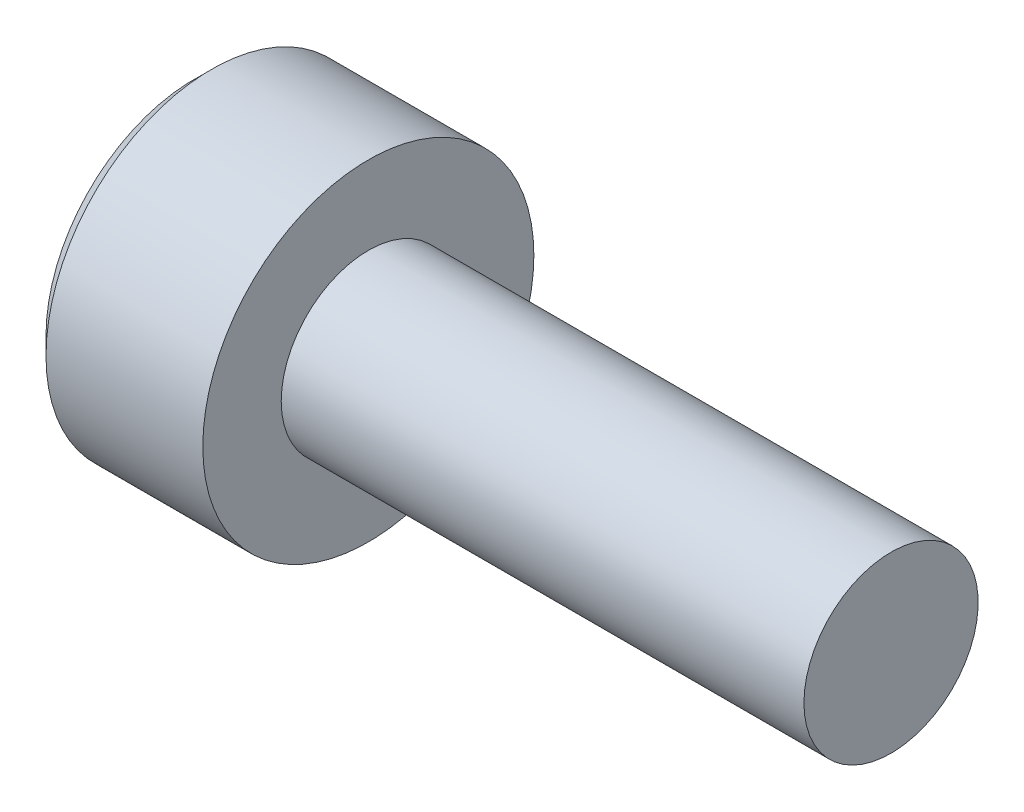
ISO-10303-21;
HEADER;
FILE_DESCRIPTION(('STEP AP214'),'2;1');
FILE_NAME('part.step','',(''),(''),'','','');
FILE_SCHEMA(('AUTOMOTIVE_DESIGN { 1 0 10303 214 1 1 1 1 }'));
ENDSEC;
DATA;
#1=APPLICATION_CONTEXT('core data for automotive mechanical design processes');
#2=APPLICATION_PROTOCOL_DEFINITION('international standard','automotive_design',2000,#1);
#3=PRODUCT_CONTEXT('',#1,'mechanical');
#4=PRODUCT('Part','Part','',(#3));
#5=PRODUCT_RELATED_PRODUCT_CATEGORY('part','',(#4));
#6=PRODUCT_DEFINITION_FORMATION('','',#4);
#7=PRODUCT_DEFINITION_CONTEXT('part definition',#1,'design');
#8=PRODUCT_DEFINITION('design','',#6,#7);
#9=PRODUCT_DEFINITION_SHAPE('','',#8);
#10=(LENGTH_UNIT() NAMED_UNIT(*) SI_UNIT(.MILLI.,.METRE.));
#11=(NAMED_UNIT(*) PLANE_ANGLE_UNIT() SI_UNIT($,.RADIAN.));
#12=(NAMED_UNIT(*) SI_UNIT($,.STERADIAN.) SOLID_ANGLE_UNIT());
#13=UNCERTAINTY_MEASURE_WITH_UNIT(LENGTH_MEASURE(1.E-05),#10,'distance_accuracy_value','');
#14=(GEOMETRIC_REPRESENTATION_CONTEXT(3) GLOBAL_UNCERTAINTY_ASSIGNED_CONTEXT((#13)) GLOBAL_UNIT_ASSIGNED_CONTEXT((#10,
#11,#12)) REPRESENTATION_CONTEXT('',''));
#15=CARTESIAN_POINT('',(0.,0.,0.));
#16=DIRECTION('',(0.,0.,1.));
#17=DIRECTION('',(1.,0.,0.));
#18=AXIS2_PLACEMENT_3D('',#15,#16,#17);
#19=CARTESIAN_POINT('',(-0.999999999976353,0.,0.));
#20=DIRECTION('',(-1.,0.,0.));
#21=DIRECTION('',(0.,0.,1.));
#22=AXIS2_PLACEMENT_3D('',#19,#20,#21);
#23=CONICAL_SURFACE('',#22,0.749999999868578,1.30899693854199);
#24=CARTESIAN_POINT('',(-0.79903810542703,0.,-5.40012479177676E-10));
#25=VERTEX_POINT('',#24);
#26=VERTEX_LOOP('',#25);
#27=FACE_BOUND('',#26,.T.);
#28=CARTESIAN_POINT('',(-1.00000000000682,0.,0.));
#29=DIRECTION('',(-1.,0.,0.));
#30=DIRECTION('',(0.,0.,1.));
#31=AXIS2_PLACEMENT_3D('',#28,#29,#30);
#32=CIRCLE('',#31,0.749999999982265);
#33=CARTESIAN_POINT('',(-1.00000000000892,0.64951905283065,-0.374999999995567));
#34=VERTEX_POINT('',#33);
#35=CARTESIAN_POINT('',(-1.00000000000952,0.,-0.749999999991132));
#36=VERTEX_POINT('',#35);
#37=EDGE_CURVE('E139',#34,#36,#32,.T.);
#38=ORIENTED_EDGE('',*,*,#37,.T.);
#39=CARTESIAN_POINT('',(-1.00000000000682,0.,0.));
#40=DIRECTION('',(-1.,0.,0.));
#41=DIRECTION('',(0.,0.,1.));
#42=AXIS2_PLACEMENT_3D('',#39,#40,#41);
#43=CIRCLE('',#42,0.749999999982265);
#44=CARTESIAN_POINT('',(-1.00000000000892,-0.649519052830649,-0.374999999995567));
#45=VERTEX_POINT('',#44);
#46=EDGE_CURVE('E137',#36,#45,#43,.T.);
#47=ORIENTED_EDGE('',*,*,#46,.T.);
#48=CARTESIAN_POINT('',(-1.00000000000682,0.,0.));
#49=DIRECTION('',(-1.,0.,0.));
#50=DIRECTION('',(0.,0.,1.));
#51=AXIS2_PLACEMENT_3D('',#48,#49,#50);
#52=CIRCLE('',#51,0.749999999982265);
#53=CARTESIAN_POINT('',(-1.00000000000892,-0.64951905283065,0.374999999995567));
#54=VERTEX_POINT('',#53);
#55=EDGE_CURVE('E89',#45,#54,#52,.T.);
#56=ORIENTED_EDGE('',*,*,#55,.T.);
#57=CARTESIAN_POINT('',(-1.00000000000682,0.,0.));
#58=DIRECTION('',(-1.,0.,0.));
#59=DIRECTION('',(0.,0.,1.));
#60=AXIS2_PLACEMENT_3D('',#57,#58,#59);
#61=CIRCLE('',#60,0.749999999982265);
#62=CARTESIAN_POINT('',(-1.00000000000952,0.,0.749999999991132));
#63=VERTEX_POINT('',#62);
#64=EDGE_CURVE('E20',#54,#63,#61,.T.);
#65=ORIENTED_EDGE('',*,*,#64,.T.);
#66=CARTESIAN_POINT('',(-1.00000000000682,0.,0.));
#67=DIRECTION('',(-1.,0.,0.));
#68=DIRECTION('',(0.,0.,1.));
#69=AXIS2_PLACEMENT_3D('',#66,#67,#68);
#70=CIRCLE('',#69,0.749999999982265);
#71=CARTESIAN_POINT('',(-1.00000000000892,0.64951905283065,0.374999999995567));
#72=VERTEX_POINT('',#71);
#73=EDGE_CURVE('E94',#63,#72,#70,.T.);
#74=ORIENTED_EDGE('',*,*,#73,.T.);
#75=CARTESIAN_POINT('',(-1.00000000000682,0.,0.));
#76=DIRECTION('',(-1.,0.,0.));
#77=DIRECTION('',(0.,0.,1.));
#78=AXIS2_PLACEMENT_3D('',#75,#76,#77);
#79=CIRCLE('',#78,0.749999999982265);
#80=EDGE_CURVE('E115',#72,#34,#79,.T.);
#81=ORIENTED_EDGE('',*,*,#80,.T.);
#82=EDGE_LOOP('',(#38,#47,#56,#65,#74,#81));
#83=FACE_BOUND('',#82,.T.);
#84=ADVANCED_FACE('F17',(#27,#83),#23,.F.);
#85=CARTESIAN_POINT('',(-1.,0.,0.));
#86=DIRECTION('',(1.,0.,0.));
#87=DIRECTION('',(0.,0.,-1.));
#88=AXIS2_PLACEMENT_3D('',#85,#86,#87);
#89=PLANE('',#88);
#90=DIRECTION('',(0.,1.,0.));
#91=VECTOR('',#90,1.);
#92=CARTESIAN_POINT('',(-1.00000000001222,0.43301270189222,0.75));
#93=LINE('',#92,#91);
#94=CARTESIAN_POINT('',(-1.00000000000611,-0.433012701895382,0.749999999994524));
#95=VERTEX_POINT('',#94);
#96=EDGE_CURVE('E99',#63,#95,#93,.F.);
#97=ORIENTED_EDGE('',*,*,#96,.F.);
#98=ORIENTED_EDGE('',*,*,#64,.F.);
#99=DIRECTION('',(0.,0.500000000000001,0.866025403784438));
#100=VECTOR('',#99,1.);
#101=CARTESIAN_POINT('',(-1.,-0.43301270189222,0.75));
#102=LINE('',#101,#100);
#103=EDGE_CURVE('E101',#95,#54,#102,.F.);
#104=ORIENTED_EDGE('',*,*,#103,.F.);
#105=EDGE_LOOP('',(#97,#98,#104));
#106=FACE_BOUND('',#105,.T.);
#107=ADVANCED_FACE('F100',(#106),#89,.F.);
#108=CARTESIAN_POINT('',(-1.,0.,0.));
#109=DIRECTION('',(1.,0.,0.));
#110=DIRECTION('',(0.,0.,-1.));
#111=AXIS2_PLACEMENT_3D('',#108,#109,#110);
#112=PLANE('',#111);
#113=DIRECTION('',(0.,0.500000000000001,-0.866025403784438));
#114=VECTOR('',#113,1.);
#115=CARTESIAN_POINT('',(-1.00000000001102,0.86602540378444,0.));
#116=LINE('',#115,#114);
#117=CARTESIAN_POINT('',(-1.00000000000551,0.43301270189222,0.75));
#118=VERTEX_POINT('',#117);
#119=EDGE_CURVE('E113',#72,#118,#116,.F.);
#120=ORIENTED_EDGE('',*,*,#119,.F.);
#121=ORIENTED_EDGE('',*,*,#73,.F.);
#122=DIRECTION('',(0.,1.,0.));
#123=VECTOR('',#122,1.);
#124=CARTESIAN_POINT('',(-1.,0.43301270189222,0.75));
#125=LINE('',#124,#123);
#126=EDGE_CURVE('E110',#118,#63,#125,.F.);
#127=ORIENTED_EDGE('',*,*,#126,.F.);
#128=EDGE_LOOP('',(#120,#121,#127));
#129=FACE_BOUND('',#128,.T.);
#130=ADVANCED_FACE('F109',(#129),#112,.F.);
#131=CARTESIAN_POINT('',(-1.,0.,0.));
#132=DIRECTION('',(1.,0.,0.));
#133=DIRECTION('',(0.,0.,-1.));
#134=AXIS2_PLACEMENT_3D('',#131,#132,#133);
#135=PLANE('',#134);
#136=DIRECTION('',(0.,0.500000000000001,-0.866025403784438));
#137=VECTOR('',#136,1.);
#138=CARTESIAN_POINT('',(-1.,0.86602540378444,0.));
#139=LINE('',#138,#137);
#140=CARTESIAN_POINT('',(-1.00000000000551,0.86602540378444,0.));
#141=VERTEX_POINT('',#140);
#142=EDGE_CURVE('E149',#141,#72,#139,.F.);
#143=ORIENTED_EDGE('',*,*,#142,.F.);
#144=DIRECTION('',(0.,-0.500000000000001,-0.866025403784438));
#145=VECTOR('',#144,1.);
#146=CARTESIAN_POINT('',(-1.00000000001102,0.43301270189222,-0.75));
#147=LINE('',#146,#145);
#148=EDGE_CURVE('E147',#34,#141,#147,.F.);
#149=ORIENTED_EDGE('',*,*,#148,.F.);
#150=ORIENTED_EDGE('',*,*,#80,.F.);
#151=EDGE_LOOP('',(#143,#149,#150));
#152=FACE_BOUND('',#151,.T.);
#153=ADVANCED_FACE('F148',(#152),#135,.F.);
#154=CARTESIAN_POINT('',(-1.,0.,0.));
#155=DIRECTION('',(1.,0.,0.));
#156=DIRECTION('',(0.,0.,-1.));
#157=AXIS2_PLACEMENT_3D('',#154,#155,#156);
#158=PLANE('',#157);
#159=DIRECTION('',(0.,1.,0.));
#160=VECTOR('',#159,1.);
#161=CARTESIAN_POINT('',(-1.00000000001222,-0.43301270189222,-0.75));
#162=LINE('',#161,#160);
#163=CARTESIAN_POINT('',(-1.00000000000611,0.433012701895382,-0.749999999994524));
#164=VERTEX_POINT('',#163);
#165=EDGE_CURVE('E161',#36,#164,#162,.T.);
#166=ORIENTED_EDGE('',*,*,#165,.F.);
#167=ORIENTED_EDGE('',*,*,#37,.F.);
#168=DIRECTION('',(0.,-0.500000000000001,-0.866025403784438));
#169=VECTOR('',#168,1.);
#170=CARTESIAN_POINT('',(-1.,0.43301270189222,-0.75));
#171=LINE('',#170,#169);
#172=EDGE_CURVE('E158',#164,#34,#171,.F.);
#173=ORIENTED_EDGE('',*,*,#172,.F.);
#174=EDGE_LOOP('',(#166,#167,#173));
#175=FACE_BOUND('',#174,.T.);
#176=ADVANCED_FACE('F157',(#175),#158,.F.);
#177=CARTESIAN_POINT('',(-1.,0.,0.));
#178=DIRECTION('',(1.,0.,0.));
#179=DIRECTION('',(0.,0.,-1.));
#180=AXIS2_PLACEMENT_3D('',#177,#178,#179);
#181=PLANE('',#180);
#182=DIRECTION('',(0.,-0.500000000000001,0.866025403784438));
#183=VECTOR('',#182,1.);
#184=CARTESIAN_POINT('',(-1.00000000001102,-0.86602540378444,0.));
#185=LINE('',#184,#183);
#186=CARTESIAN_POINT('',(-1.00000000000551,-0.43301270189222,-0.75));
#187=VERTEX_POINT('',#186);
#188=EDGE_CURVE('E187',#45,#187,#185,.F.);
#189=ORIENTED_EDGE('',*,*,#188,.F.);
#190=ORIENTED_EDGE('',*,*,#46,.F.);
#191=DIRECTION('',(0.,1.,0.));
#192=VECTOR('',#191,1.);
#193=CARTESIAN_POINT('',(-1.,-0.43301270189222,-0.75));
#194=LINE('',#193,#192);
#195=EDGE_CURVE('E191',#187,#36,#194,.T.);
#196=ORIENTED_EDGE('',*,*,#195,.F.);
#197=EDGE_LOOP('',(#189,#190,#196));
#198=FACE_BOUND('',#197,.T.);
#199=ADVANCED_FACE('F337',(#198),#181,.F.);
#200=CARTESIAN_POINT('',(-1.,0.,0.));
#201=DIRECTION('',(1.,0.,0.));
#202=DIRECTION('',(0.,0.,-1.));
#203=AXIS2_PLACEMENT_3D('',#200,#201,#202);
#204=PLANE('',#203);
#205=DIRECTION('',(0.,0.500000000000001,0.866025403784438));
#206=VECTOR('',#205,1.);
#207=CARTESIAN_POINT('',(-1.00000000001102,-0.43301270189222,0.75));
#208=LINE('',#207,#206);
#209=CARTESIAN_POINT('',(-1.00000000000367,-0.86602540378444,0.));
#210=VERTEX_POINT('',#209);
#211=EDGE_CURVE('E124',#54,#210,#208,.F.);
#212=ORIENTED_EDGE('',*,*,#211,.F.);
#213=ORIENTED_EDGE('',*,*,#55,.F.);
#214=DIRECTION('',(0.,-0.500000000000001,0.866025403784438));
#215=VECTOR('',#214,1.);
#216=CARTESIAN_POINT('',(-1.,-0.86602540378444,0.));
#217=LINE('',#216,#215);
#218=EDGE_CURVE('E192',#210,#45,#217,.F.);
#219=ORIENTED_EDGE('',*,*,#218,.F.);
#220=EDGE_LOOP('',(#212,#213,#219));
#221=FACE_BOUND('',#220,.T.);
#222=ADVANCED_FACE('F328',(#221),#204,.F.);
#223=CARTESIAN_POINT('',(-1.,-0.43301270189222,0.75));
#224=DIRECTION('',(0.,0.866025403784438,-0.500000000000001));
#225=DIRECTION('',(0.,0.500000000000001,0.866025403784438));
#226=AXIS2_PLACEMENT_3D('',#223,#224,#225);
#227=PLANE('',#226);
#228=DIRECTION('',(-1.,0.,0.));
#229=VECTOR('',#228,1.);
#230=CARTESIAN_POINT('',(-1.,-0.43301270189222,0.75));
#231=LINE('',#230,#229);
#232=CARTESIAN_POINT('',(-2.,-0.43301270189222,0.75));
#233=VERTEX_POINT('',#232);
#234=EDGE_CURVE('E106',#95,#233,#231,.T.);
#235=ORIENTED_EDGE('',*,*,#234,.F.);
#236=ORIENTED_EDGE('',*,*,#103,.T.);
#237=ORIENTED_EDGE('',*,*,#211,.T.);
#238=DIRECTION('',(1.,0.,0.));
#239=VECTOR('',#238,1.);
#240=CARTESIAN_POINT('',(-1.,-0.86602540378444,0.));
#241=LINE('',#240,#239);
#242=CARTESIAN_POINT('',(-2.,-0.86602540378444,0.));
#243=VERTEX_POINT('',#242);
#244=EDGE_CURVE('E195',#243,#210,#241,.T.);
#245=ORIENTED_EDGE('',*,*,#244,.F.);
#246=DIRECTION('',(0.,0.500000000000001,0.866025403784438));
#247=VECTOR('',#246,1.);
#248=CARTESIAN_POINT('',(-2.,-0.86602540378444,0.));
#249=LINE('',#248,#247);
#250=EDGE_CURVE('E183',#243,#233,#249,.T.);
#251=ORIENTED_EDGE('',*,*,#250,.T.);
#252=EDGE_LOOP('',(#235,#236,#237,#245,#251));
#253=FACE_BOUND('',#252,.T.);
#254=ADVANCED_FACE('F320',(#253),#227,.T.);
#255=CARTESIAN_POINT('',(-1.,0.43301270189222,0.75));
#256=DIRECTION('',(0.,0.,-1.));
#257=DIRECTION('',(-1.,0.,0.));
#258=AXIS2_PLACEMENT_3D('',#255,#256,#257);
#259=PLANE('',#258);
#260=DIRECTION('',(1.,0.,0.));
#261=VECTOR('',#260,1.);
#262=CARTESIAN_POINT('',(-1.,0.43301270189222,0.75));
#263=LINE('',#262,#261);
#264=CARTESIAN_POINT('',(-2.,0.43301270189222,0.75));
#265=VERTEX_POINT('',#264);
#266=EDGE_CURVE('E118',#118,#265,#263,.F.);
#267=ORIENTED_EDGE('',*,*,#266,.F.);
#268=ORIENTED_EDGE('',*,*,#126,.T.);
#269=ORIENTED_EDGE('',*,*,#96,.T.);
#270=ORIENTED_EDGE('',*,*,#234,.T.);
#271=DIRECTION('',(0.,1.,0.));
#272=VECTOR('',#271,1.);
#273=CARTESIAN_POINT('',(-2.,0.,0.75));
#274=LINE('',#273,#272);
#275=EDGE_CURVE('E179',#233,#265,#274,.T.);
#276=ORIENTED_EDGE('',*,*,#275,.T.);
#277=EDGE_LOOP('',(#267,#268,#269,#270,#276));
#278=FACE_BOUND('',#277,.T.);
#279=ADVANCED_FACE('F116',(#278),#259,.T.);
#280=CARTESIAN_POINT('',(-1.,0.86602540378444,0.));
#281=DIRECTION('',(0.,-0.866025403784438,-0.500000000000001));
#282=DIRECTION('',(0.,0.500000000000001,-0.866025403784438));
#283=AXIS2_PLACEMENT_3D('',#280,#281,#282);
#284=PLANE('',#283);
#285=DIRECTION('',(1.,0.,0.));
#286=VECTOR('',#285,1.);
#287=CARTESIAN_POINT('',(-1.,0.86602540378444,0.));
#288=LINE('',#287,#286);
#289=CARTESIAN_POINT('',(-2.,0.86602540378444,0.));
#290=VERTEX_POINT('',#289);
#291=EDGE_CURVE('E154',#141,#290,#288,.F.);
#292=ORIENTED_EDGE('',*,*,#291,.F.);
#293=ORIENTED_EDGE('',*,*,#142,.T.);
#294=ORIENTED_EDGE('',*,*,#119,.T.);
#295=ORIENTED_EDGE('',*,*,#266,.T.);
#296=DIRECTION('',(0.,0.500000000000001,-0.866025403784438));
#297=VECTOR('',#296,1.);
#298=CARTESIAN_POINT('',(-2.,0.43301270189222,0.75));
#299=LINE('',#298,#297);
#300=EDGE_CURVE('E173',#265,#290,#299,.T.);
#301=ORIENTED_EDGE('',*,*,#300,.T.);
#302=EDGE_LOOP('',(#292,#293,#294,#295,#301));
#303=FACE_BOUND('',#302,.T.);
#304=ADVANCED_FACE('F172',(#303),#284,.T.);
#305=CARTESIAN_POINT('',(-1.,0.43301270189222,-0.75));
#306=DIRECTION('',(0.,-0.866025403784438,0.500000000000001));
#307=DIRECTION('',(0.,-0.500000000000001,-0.866025403784438));
#308=AXIS2_PLACEMENT_3D('',#305,#306,#307);
#309=PLANE('',#308);
#310=DIRECTION('',(1.,0.,0.));
#311=VECTOR('',#310,1.);
#312=CARTESIAN_POINT('',(-1.,0.43301270189222,-0.75));
#313=LINE('',#312,#311);
#314=CARTESIAN_POINT('',(-2.,0.43301270189222,-0.75));
#315=VERTEX_POINT('',#314);
#316=EDGE_CURVE('E164',#164,#315,#313,.F.);
#317=ORIENTED_EDGE('',*,*,#316,.F.);
#318=ORIENTED_EDGE('',*,*,#172,.T.);
#319=ORIENTED_EDGE('',*,*,#148,.T.);
#320=ORIENTED_EDGE('',*,*,#291,.T.);
#321=DIRECTION('',(0.,-0.500000000000001,-0.866025403784438));
#322=VECTOR('',#321,1.);
#323=CARTESIAN_POINT('',(-2.,0.86602540378444,0.));
#324=LINE('',#323,#322);
#325=EDGE_CURVE('E180',#290,#315,#324,.T.);
#326=ORIENTED_EDGE('',*,*,#325,.T.);
#327=EDGE_LOOP('',(#317,#318,#319,#320,#326));
#328=FACE_BOUND('',#327,.T.);
#329=ADVANCED_FACE('F163',(#328),#309,.T.);
#330=CARTESIAN_POINT('',(-1.,-0.43301270189222,-0.75));
#331=DIRECTION('',(0.,0.,1.));
#332=DIRECTION('',(1.,0.,0.));
#333=AXIS2_PLACEMENT_3D('',#330,#331,#332);
#334=PLANE('',#333);
#335=DIRECTION('',(1.,0.,0.));
#336=VECTOR('',#335,1.);
#337=CARTESIAN_POINT('',(-1.,-0.43301270189222,-0.75));
#338=LINE('',#337,#336);
#339=CARTESIAN_POINT('',(-2.,-0.43301270189222,-0.75));
#340=VERTEX_POINT('',#339);
#341=EDGE_CURVE('E190',#187,#340,#338,.F.);
#342=ORIENTED_EDGE('',*,*,#341,.F.);
#343=ORIENTED_EDGE('',*,*,#195,.T.);
#344=ORIENTED_EDGE('',*,*,#165,.T.);
#345=ORIENTED_EDGE('',*,*,#316,.T.);
#346=DIRECTION('',(0.,1.,0.));
#347=VECTOR('',#346,1.);
#348=CARTESIAN_POINT('',(-2.,0.,-0.75));
#349=LINE('',#348,#347);
#350=EDGE_CURVE('E35',#315,#340,#349,.F.);
#351=ORIENTED_EDGE('',*,*,#350,.T.);
#352=EDGE_LOOP('',(#342,#343,#344,#345,#351));
#353=FACE_BOUND('',#352,.T.);
#354=ADVANCED_FACE('F204',(#353),#334,.T.);
#355=CARTESIAN_POINT('',(-1.,-0.86602540378444,0.));
#356=DIRECTION('',(0.,0.866025403784438,0.500000000000001));
#357=DIRECTION('',(0.,-0.500000000000001,0.866025403784438));
#358=AXIS2_PLACEMENT_3D('',#355,#356,#357);
#359=PLANE('',#358);
#360=ORIENTED_EDGE('',*,*,#244,.T.);
#361=ORIENTED_EDGE('',*,*,#218,.T.);
#362=ORIENTED_EDGE('',*,*,#188,.T.);
#363=ORIENTED_EDGE('',*,*,#341,.T.);
#364=DIRECTION('',(0.,-0.500000000000001,0.866025403784438));
#365=VECTOR('',#364,1.);
#366=CARTESIAN_POINT('',(-2.,-0.43301270189222,-0.75));
#367=LINE('',#366,#365);
#368=EDGE_CURVE('E135',#340,#243,#367,.T.);
#369=ORIENTED_EDGE('',*,*,#368,.T.);
#370=EDGE_LOOP('',(#360,#361,#362,#363,#369));
#371=FACE_BOUND('',#370,.T.);
#372=ADVANCED_FACE('F224',(#371),#359,.T.);
#373=CARTESIAN_POINT('',(-2.,0.,0.));
#374=DIRECTION('',(1.,0.,0.));
#375=DIRECTION('',(0.,0.,-1.));
#376=AXIS2_PLACEMENT_3D('',#373,#374,#375);
#377=PLANE('',#376);
#378=CARTESIAN_POINT('',(-1.99999999995271,0.,0.));
#379=DIRECTION('',(1.,0.,0.));
#380=DIRECTION('',(0.,0.,-1.));
#381=AXIS2_PLACEMENT_3D('',#378,#379,#380);
#382=CIRCLE('',#381,1.70000000008486);
#383=CARTESIAN_POINT('',(-1.99999999995271,0.,-1.70000000008486));
#384=VERTEX_POINT('',#383);
#385=EDGE_CURVE('E132',#384,#384,#382,.T.);
#386=ORIENTED_EDGE('',*,*,#385,.F.);
#387=EDGE_LOOP('',(#386));
#388=FACE_BOUND('',#387,.T.);
#389=ORIENTED_EDGE('',*,*,#350,.F.);
#390=ORIENTED_EDGE('',*,*,#325,.F.);
#391=ORIENTED_EDGE('',*,*,#300,.F.);
#392=ORIENTED_EDGE('',*,*,#275,.F.);
#393=ORIENTED_EDGE('',*,*,#250,.F.);
#394=ORIENTED_EDGE('',*,*,#368,.F.);
#395=EDGE_LOOP('',(#389,#390,#391,#392,#393,#394));
#396=FACE_BOUND('',#395,.T.);
#397=ADVANCED_FACE('F177',(#388,#396),#377,.F.);
#398=CARTESIAN_POINT('',(-1.79999999988922,0.,0.));
#399=DIRECTION('',(1.,0.,0.));
#400=DIRECTION('',(0.,0.,-1.));
#401=AXIS2_PLACEMENT_3D('',#398,#399,#400);
#402=CONICAL_SURFACE('',#401,1.9000000000915,0.78539816325534);
#403=ORIENTED_EDGE('',*,*,#385,.T.);
#404=EDGE_LOOP('',(#403));
#405=FACE_BOUND('',#404,.T.);
#406=CARTESIAN_POINT('',(-1.8,0.,0.));
#407=DIRECTION('',(1.,0.,0.));
#408=DIRECTION('',(0.,0.,-1.));
#409=AXIS2_PLACEMENT_3D('',#406,#407,#408);
#410=CIRCLE('',#409,1.9);
#411=CARTESIAN_POINT('',(-1.8,0.,-1.9));
#412=VERTEX_POINT('',#411);
#413=EDGE_CURVE('E131',#412,#412,#410,.T.);
#414=ORIENTED_EDGE('',*,*,#413,.F.);
#415=EDGE_LOOP('',(#414));
#416=FACE_BOUND('',#415,.T.);
#417=ADVANCED_FACE('F213',(#405,#416),#402,.T.);
#418=CARTESIAN_POINT('',(6.,0.,0.));
#419=DIRECTION('',(1.,0.,0.));
#420=DIRECTION('',(0.,0.,-1.));
#421=AXIS2_PLACEMENT_3D('',#418,#419,#420);
#422=CYLINDRICAL_SURFACE('',#421,1.9);
#423=ORIENTED_EDGE('',*,*,#413,.T.);
#424=EDGE_LOOP('',(#423));
#425=FACE_BOUND('',#424,.T.);
#426=CARTESIAN_POINT('',(0.,0.,0.));
#427=DIRECTION('',(1.,0.,0.));
#428=DIRECTION('',(0.,0.,-1.));
#429=AXIS2_PLACEMENT_3D('',#426,#427,#428);
#430=CIRCLE('',#429,1.9);
#431=CARTESIAN_POINT('',(0.,0.,-1.9));
#432=VERTEX_POINT('',#431);
#433=EDGE_CURVE('E128',#432,#432,#430,.F.);
#434=ORIENTED_EDGE('',*,*,#433,.T.);
#435=EDGE_LOOP('',(#434));
#436=FACE_BOUND('',#435,.T.);
#437=ADVANCED_FACE('F210',(#425,#436),#422,.T.);
#438=CARTESIAN_POINT('',(6.,0.,0.));
#439=DIRECTION('',(1.,0.,0.));
#440=DIRECTION('',(0.,0.,-1.));
#441=AXIS2_PLACEMENT_3D('',#438,#439,#440);
#442=PLANE('',#441);
#443=CARTESIAN_POINT('',(6.,0.,0.));
#444=DIRECTION('',(-1.,0.,0.));
#445=DIRECTION('',(0.,0.,1.));
#446=AXIS2_PLACEMENT_3D('',#443,#444,#445);
#447=CIRCLE('',#446,1.);
#448=CARTESIAN_POINT('',(6.,0.,1.));
#449=VERTEX_POINT('',#448);
#450=EDGE_CURVE('E26',#449,#449,#447,.T.);
#451=ORIENTED_EDGE('',*,*,#450,.F.);
#452=EDGE_LOOP('',(#451));
#453=FACE_BOUND('',#452,.T.);
#454=ADVANCED_FACE('F222',(#453),#442,.T.);
#455=CARTESIAN_POINT('',(0.,1.9,0.));
#456=DIRECTION('',(-1.,0.,0.));
#457=DIRECTION('',(0.,0.,1.));
#458=AXIS2_PLACEMENT_3D('',#455,#456,#457);
#459=PLANE('',#458);
#460=ORIENTED_EDGE('',*,*,#433,.F.);
#461=EDGE_LOOP('',(#460));
#462=FACE_BOUND('',#461,.T.);
#463=CARTESIAN_POINT('',(0.,0.,0.));
#464=DIRECTION('',(-1.,0.,0.));
#465=DIRECTION('',(0.,0.,1.));
#466=AXIS2_PLACEMENT_3D('',#463,#464,#465);
#467=CIRCLE('',#466,1.);
#468=CARTESIAN_POINT('',(0.,0.,1.));
#469=VERTEX_POINT('',#468);
#470=EDGE_CURVE('E10',#469,#469,#467,.F.);
#471=ORIENTED_EDGE('',*,*,#470,.F.);
#472=EDGE_LOOP('',(#471));
#473=FACE_BOUND('',#472,.T.);
#474=ADVANCED_FACE('F229',(#462,#473),#459,.F.);
#475=CARTESIAN_POINT('',(6.,0.,0.));
#476=DIRECTION('',(-1.,0.,0.));
#477=DIRECTION('',(0.,0.,1.));
#478=AXIS2_PLACEMENT_3D('',#475,#476,#477);
#479=CYLINDRICAL_SURFACE('',#478,1.);
#480=ORIENTED_EDGE('',*,*,#470,.T.);
#481=EDGE_LOOP('',(#480));
#482=FACE_BOUND('',#481,.T.);
#483=ORIENTED_EDGE('',*,*,#450,.T.);
#484=EDGE_LOOP('',(#483));
#485=FACE_BOUND('',#484,.T.);
#486=ADVANCED_FACE('F227',(#482,#485),#479,.T.);
#487=CLOSED_SHELL('',(#84,#107,#130,#153,#176,#199,#222,#254,#279,#304,#329,#354,#372,#397,#417,
#437,#454,#474,#486));
#488=MANIFOLD_SOLID_BREP('B1',#487);
#489=ADVANCED_BREP_SHAPE_REPRESENTATION('',(#18,#488),#14);
#490=SHAPE_DEFINITION_REPRESENTATION(#9,#489);
ENDSEC;
END-ISO-10303-21;
